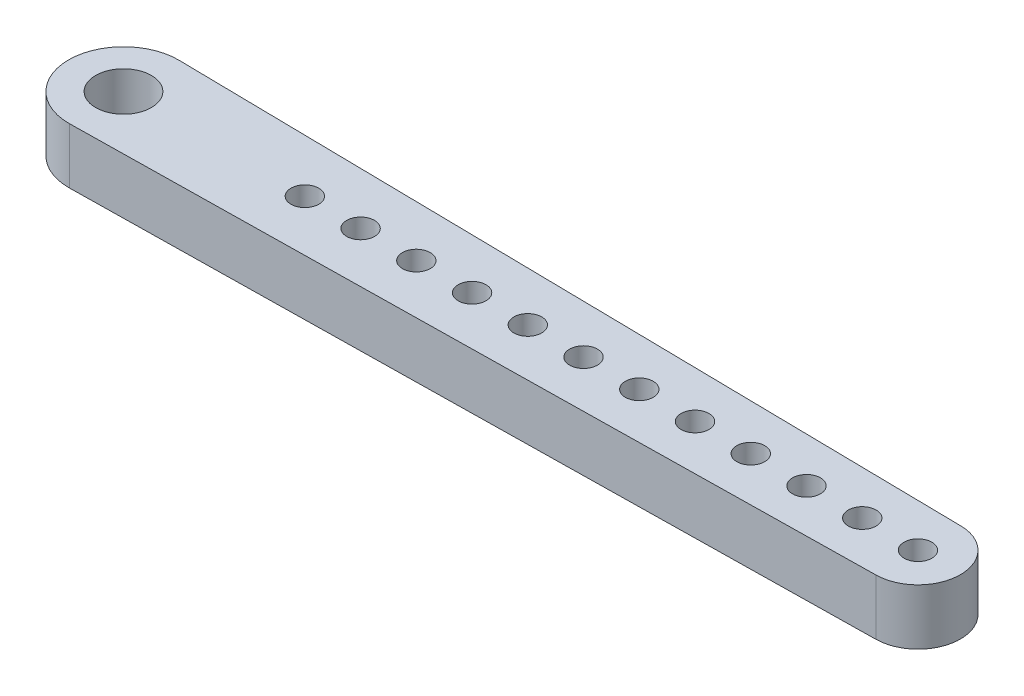
ISO-10303-21;
HEADER;
FILE_DESCRIPTION(('STEP AP214'),'2;1');
FILE_NAME('part.step','',(''),(''),'','','');
FILE_SCHEMA(('AUTOMOTIVE_DESIGN { 1 0 10303 214 1 1 1 1 }'));
ENDSEC;
DATA;
#1=APPLICATION_CONTEXT('core data for automotive mechanical design processes');
#2=APPLICATION_PROTOCOL_DEFINITION('international standard','automotive_design',2000,#1);
#3=PRODUCT_CONTEXT('',#1,'mechanical');
#4=PRODUCT('Part','Part','',(#3));
#5=PRODUCT_RELATED_PRODUCT_CATEGORY('part','',(#4));
#6=PRODUCT_DEFINITION_FORMATION('','',#4);
#7=PRODUCT_DEFINITION_CONTEXT('part definition',#1,'design');
#8=PRODUCT_DEFINITION('design','',#6,#7);
#9=PRODUCT_DEFINITION_SHAPE('','',#8);
#10=(LENGTH_UNIT() NAMED_UNIT(*) SI_UNIT(.MILLI.,.METRE.));
#11=(NAMED_UNIT(*) PLANE_ANGLE_UNIT() SI_UNIT($,.RADIAN.));
#12=(NAMED_UNIT(*) SI_UNIT($,.STERADIAN.) SOLID_ANGLE_UNIT());
#13=UNCERTAINTY_MEASURE_WITH_UNIT(LENGTH_MEASURE(1.E-05),#10,'distance_accuracy_value','');
#14=(GEOMETRIC_REPRESENTATION_CONTEXT(3) GLOBAL_UNCERTAINTY_ASSIGNED_CONTEXT((#13)) GLOBAL_UNIT_ASSIGNED_CONTEXT((#10,
#11,#12)) REPRESENTATION_CONTEXT('',''));
#15=CARTESIAN_POINT('',(0.,0.,0.));
#16=DIRECTION('',(0.,0.,1.));
#17=DIRECTION('',(1.,0.,0.));
#18=AXIS2_PLACEMENT_3D('',#15,#16,#17);
#19=CARTESIAN_POINT('',(6.25155634917897,6.35,0.));
#20=DIRECTION('',(0.,-1.,0.));
#21=DIRECTION('',(0.,0.,-1.));
#22=AXIS2_PLACEMENT_3D('',#19,#20,#21);
#23=CYLINDRICAL_SURFACE('',#22,6.25155634917897);
#24=DIRECTION('',(0.,1.,0.));
#25=VECTOR('',#24,1.);
#26=CARTESIAN_POINT('',(6.34922499542032,6.35,6.25079335944656));
#27=LINE('',#26,#25);
#28=CARTESIAN_POINT('',(6.34922499542032,6.35,6.25079335944656));
#29=VERTEX_POINT('',#28);
#30=CARTESIAN_POINT('',(6.34922499542032,0.,6.25079335944656));
#31=VERTEX_POINT('',#30);
#32=EDGE_CURVE('E97',#29,#31,#27,.F.);
#33=ORIENTED_EDGE('',*,*,#32,.F.);
#34=CARTESIAN_POINT('',(6.25155634917897,6.35,0.));
#35=DIRECTION('',(0.,-1.,0.));
#36=DIRECTION('',(0.,0.,-1.));
#37=AXIS2_PLACEMENT_3D('',#34,#35,#36);
#38=CIRCLE('',#37,6.25155634917897);
#39=CARTESIAN_POINT('',(6.34922499542032,6.35,-6.25079335944656));
#40=VERTEX_POINT('',#39);
#41=EDGE_CURVE('E56',#40,#29,#38,.F.);
#42=ORIENTED_EDGE('',*,*,#41,.F.);
#43=DIRECTION('',(0.,-1.,0.));
#44=VECTOR('',#43,1.);
#45=CARTESIAN_POINT('',(6.34922499542032,6.35,-6.25079335944656));
#46=LINE('',#45,#44);
#47=CARTESIAN_POINT('',(6.34922499542032,0.,-6.25079335944656));
#48=VERTEX_POINT('',#47);
#49=EDGE_CURVE('E113',#48,#40,#46,.F.);
#50=ORIENTED_EDGE('',*,*,#49,.F.);
#51=CARTESIAN_POINT('',(6.25155634917897,0.,0.));
#52=DIRECTION('',(0.,-1.,0.));
#53=DIRECTION('',(0.,0.,-1.));
#54=AXIS2_PLACEMENT_3D('',#51,#52,#53);
#55=CIRCLE('',#54,6.25155634917897);
#56=EDGE_CURVE('E49',#31,#48,#55,.T.);
#57=ORIENTED_EDGE('',*,*,#56,.F.);
#58=EDGE_LOOP('',(#33,#42,#50,#57));
#59=FACE_BOUND('',#58,.T.);
#60=ADVANCED_FACE('F34',(#59),#23,.T.);
#61=CARTESIAN_POINT('',(96.7625046131157,0.,0.));
#62=DIRECTION('',(0.,-1.,0.));
#63=DIRECTION('',(0.,0.,-1.));
#64=AXIS2_PLACEMENT_3D('',#61,#62,#63);
#65=CYLINDRICAL_SURFACE('',#64,4.83749538688425);
#66=DIRECTION('',(0.,1.,0.));
#67=VECTOR('',#66,1.);
#68=CARTESIAN_POINT('',(96.8380812534347,0.,4.83690498041511));
#69=LINE('',#68,#67);
#70=CARTESIAN_POINT('',(96.8380812534347,0.,4.83690498041511));
#71=VERTEX_POINT('',#70);
#72=CARTESIAN_POINT('',(96.8380812534347,6.35,4.83690498041511));
#73=VERTEX_POINT('',#72);
#74=EDGE_CURVE('E88',#71,#73,#69,.T.);
#75=ORIENTED_EDGE('',*,*,#74,.F.);
#76=CARTESIAN_POINT('',(96.7625046131157,0.,0.));
#77=DIRECTION('',(0.,-1.,0.));
#78=DIRECTION('',(0.,0.,-1.));
#79=AXIS2_PLACEMENT_3D('',#76,#77,#78);
#80=CIRCLE('',#79,4.83749538688425);
#81=CARTESIAN_POINT('',(96.8380812534347,0.,-4.83690498041509));
#82=VERTEX_POINT('',#81);
#83=EDGE_CURVE('E73',#82,#71,#80,.T.);
#84=ORIENTED_EDGE('',*,*,#83,.F.);
#85=DIRECTION('',(0.,-1.,0.));
#86=VECTOR('',#85,1.);
#87=CARTESIAN_POINT('',(96.8380812534347,6.35,-4.83690498041509));
#88=LINE('',#87,#86);
#89=CARTESIAN_POINT('',(96.8380812534347,6.35,-4.83690498041509));
#90=VERTEX_POINT('',#89);
#91=EDGE_CURVE('E85',#90,#82,#88,.T.);
#92=ORIENTED_EDGE('',*,*,#91,.F.);
#93=CARTESIAN_POINT('',(96.7625046131157,6.35,0.));
#94=DIRECTION('',(0.,-1.,0.));
#95=DIRECTION('',(0.,0.,-1.));
#96=AXIS2_PLACEMENT_3D('',#93,#94,#95);
#97=CIRCLE('',#96,4.83749538688425);
#98=EDGE_CURVE('E84',#73,#90,#97,.F.);
#99=ORIENTED_EDGE('',*,*,#98,.F.);
#100=EDGE_LOOP('',(#75,#84,#92,#99));
#101=FACE_BOUND('',#100,.T.);
#102=ADVANCED_FACE('F89',(#101),#65,.T.);
#103=CARTESIAN_POINT('',(0.,6.35,-6.35));
#104=DIRECTION('',(-0.015623093000542,0.,0.999877952034695));
#105=DIRECTION('',(0.999877952034695,0.,0.015623093000542));
#106=AXIS2_PLACEMENT_3D('',#103,#104,#105);
#107=PLANE('',#106);
#108=DIRECTION('',(-0.999877952034695,0.,-0.015623093000542));
#109=VECTOR('',#108,1.);
#110=CARTESIAN_POINT('',(0.,0.,-6.35));
#111=LINE('',#110,#109);
#112=EDGE_CURVE('E80',#82,#48,#111,.T.);
#113=ORIENTED_EDGE('',*,*,#112,.T.);
#114=ORIENTED_EDGE('',*,*,#49,.T.);
#115=DIRECTION('',(-0.999877952034695,0.,-0.015623093000542));
#116=VECTOR('',#115,1.);
#117=CARTESIAN_POINT('',(0.,6.35,-6.35));
#118=LINE('',#117,#116);
#119=EDGE_CURVE('E93',#90,#40,#118,.T.);
#120=ORIENTED_EDGE('',*,*,#119,.F.);
#121=ORIENTED_EDGE('',*,*,#91,.T.);
#122=EDGE_LOOP('',(#113,#114,#120,#121));
#123=FACE_BOUND('',#122,.T.);
#124=ADVANCED_FACE('F175',(#123),#107,.F.);
#125=CARTESIAN_POINT('',(0.,6.35,0.));
#126=DIRECTION('',(0.,-1.,0.));
#127=DIRECTION('',(0.,0.,-1.));
#128=AXIS2_PLACEMENT_3D('',#125,#126,#127);
#129=PLANE('',#128);
#130=CARTESIAN_POINT('',(84.0625046131157,6.35,0.));
#131=DIRECTION('',(0.,1.,0.));
#132=DIRECTION('',(0.,0.,1.));
#133=AXIS2_PLACEMENT_3D('',#130,#131,#132);
#134=CIRCLE('',#133,1.5875);
#135=CARTESIAN_POINT('',(84.0625046131157,6.35,1.5875));
#136=VERTEX_POINT('',#135);
#137=EDGE_CURVE('E385',#136,#136,#134,.T.);
#138=ORIENTED_EDGE('',*,*,#137,.F.);
#139=EDGE_LOOP('',(#138));
#140=FACE_BOUND('',#139,.T.);
#141=CARTESIAN_POINT('',(90.4125046131157,6.35,0.));
#142=DIRECTION('',(0.,1.,0.));
#143=DIRECTION('',(0.,0.,1.));
#144=AXIS2_PLACEMENT_3D('',#141,#142,#143);
#145=CIRCLE('',#144,1.5875);
#146=CARTESIAN_POINT('',(90.4125046131157,6.35,1.5875));
#147=VERTEX_POINT('',#146);
#148=EDGE_CURVE('E382',#147,#147,#145,.T.);
#149=ORIENTED_EDGE('',*,*,#148,.F.);
#150=EDGE_LOOP('',(#149));
#151=FACE_BOUND('',#150,.T.);
#152=CARTESIAN_POINT('',(96.7625046131157,6.35,0.));
#153=DIRECTION('',(0.,1.,0.));
#154=DIRECTION('',(0.,0.,1.));
#155=AXIS2_PLACEMENT_3D('',#152,#153,#154);
#156=CIRCLE('',#155,1.5875);
#157=CARTESIAN_POINT('',(96.7625046131157,6.35,1.58750000000001));
#158=VERTEX_POINT('',#157);
#159=EDGE_CURVE('E376',#158,#158,#156,.T.);
#160=ORIENTED_EDGE('',*,*,#159,.F.);
#161=EDGE_LOOP('',(#160));
#162=FACE_BOUND('',#161,.T.);
#163=CARTESIAN_POINT('',(6.25155634917897,6.35,0.));
#164=DIRECTION('',(0.,1.,0.));
#165=DIRECTION('',(0.,0.,1.));
#166=AXIS2_PLACEMENT_3D('',#163,#164,#165);
#167=CIRCLE('',#166,3.175);
#168=CARTESIAN_POINT('',(6.25155634917897,6.35,3.175));
#169=VERTEX_POINT('',#168);
#170=EDGE_CURVE('E103',#169,#169,#167,.T.);
#171=ORIENTED_EDGE('',*,*,#170,.F.);
#172=EDGE_LOOP('',(#171));
#173=FACE_BOUND('',#172,.T.);
#174=ORIENTED_EDGE('',*,*,#119,.T.);
#175=ORIENTED_EDGE('',*,*,#41,.T.);
#176=DIRECTION('',(-0.999877952034695,0.,0.0156230930005419));
#177=VECTOR('',#176,1.);
#178=CARTESIAN_POINT('',(0.,6.35,6.35));
#179=LINE('',#178,#177);
#180=EDGE_CURVE('E98',#73,#29,#179,.T.);
#181=ORIENTED_EDGE('',*,*,#180,.F.);
#182=ORIENTED_EDGE('',*,*,#98,.T.);
#183=EDGE_LOOP('',(#174,#175,#181,#182));
#184=FACE_BOUND('',#183,.T.);
#185=CARTESIAN_POINT('',(77.7125046131158,6.35,0.));
#186=DIRECTION('',(0.,1.,0.));
#187=DIRECTION('',(0.,0.,1.));
#188=AXIS2_PLACEMENT_3D('',#185,#186,#187);
#189=CIRCLE('',#188,1.5875);
#190=CARTESIAN_POINT('',(77.7125046131158,6.35,1.5875));
#191=VERTEX_POINT('',#190);
#192=EDGE_CURVE('E120',#191,#191,#189,.T.);
#193=ORIENTED_EDGE('',*,*,#192,.F.);
#194=EDGE_LOOP('',(#193));
#195=FACE_BOUND('',#194,.T.);
#196=CARTESIAN_POINT('',(71.3625046131157,6.35,0.));
#197=DIRECTION('',(0.,1.,0.));
#198=DIRECTION('',(0.,0.,1.));
#199=AXIS2_PLACEMENT_3D('',#196,#197,#198);
#200=CIRCLE('',#199,1.5875);
#201=CARTESIAN_POINT('',(71.3625046131157,6.35,1.5875));
#202=VERTEX_POINT('',#201);
#203=EDGE_CURVE('E126',#202,#202,#200,.T.);
#204=ORIENTED_EDGE('',*,*,#203,.F.);
#205=EDGE_LOOP('',(#204));
#206=FACE_BOUND('',#205,.T.);
#207=CARTESIAN_POINT('',(65.0125046131158,6.35,0.));
#208=DIRECTION('',(0.,1.,0.));
#209=DIRECTION('',(0.,0.,1.));
#210=AXIS2_PLACEMENT_3D('',#207,#208,#209);
#211=CIRCLE('',#210,1.5875);
#212=CARTESIAN_POINT('',(65.0125046131158,6.35,1.5875));
#213=VERTEX_POINT('',#212);
#214=EDGE_CURVE('E132',#213,#213,#211,.T.);
#215=ORIENTED_EDGE('',*,*,#214,.F.);
#216=EDGE_LOOP('',(#215));
#217=FACE_BOUND('',#216,.T.);
#218=CARTESIAN_POINT('',(58.6625046131158,6.35,0.));
#219=DIRECTION('',(0.,1.,0.));
#220=DIRECTION('',(0.,0.,1.));
#221=AXIS2_PLACEMENT_3D('',#218,#219,#220);
#222=CIRCLE('',#221,1.5875);
#223=CARTESIAN_POINT('',(58.6625046131158,6.35,1.5875));
#224=VERTEX_POINT('',#223);
#225=EDGE_CURVE('E138',#224,#224,#222,.T.);
#226=ORIENTED_EDGE('',*,*,#225,.F.);
#227=EDGE_LOOP('',(#226));
#228=FACE_BOUND('',#227,.T.);
#229=CARTESIAN_POINT('',(52.3125046131158,6.35,0.));
#230=DIRECTION('',(0.,1.,0.));
#231=DIRECTION('',(0.,0.,1.));
#232=AXIS2_PLACEMENT_3D('',#229,#230,#231);
#233=CIRCLE('',#232,1.5875);
#234=CARTESIAN_POINT('',(52.3125046131158,6.35,1.5875));
#235=VERTEX_POINT('',#234);
#236=EDGE_CURVE('E144',#235,#235,#233,.T.);
#237=ORIENTED_EDGE('',*,*,#236,.F.);
#238=EDGE_LOOP('',(#237));
#239=FACE_BOUND('',#238,.T.);
#240=CARTESIAN_POINT('',(45.9625046131158,6.35,0.));
#241=DIRECTION('',(0.,1.,0.));
#242=DIRECTION('',(0.,0.,1.));
#243=AXIS2_PLACEMENT_3D('',#240,#241,#242);
#244=CIRCLE('',#243,1.5875);
#245=CARTESIAN_POINT('',(45.9625046131158,6.35,1.5875));
#246=VERTEX_POINT('',#245);
#247=EDGE_CURVE('E150',#246,#246,#244,.T.);
#248=ORIENTED_EDGE('',*,*,#247,.F.);
#249=EDGE_LOOP('',(#248));
#250=FACE_BOUND('',#249,.T.);
#251=CARTESIAN_POINT('',(39.6125046131158,6.35,0.));
#252=DIRECTION('',(0.,1.,0.));
#253=DIRECTION('',(0.,0.,1.));
#254=AXIS2_PLACEMENT_3D('',#251,#252,#253);
#255=CIRCLE('',#254,1.5875);
#256=CARTESIAN_POINT('',(39.6125046131158,6.35,1.5875));
#257=VERTEX_POINT('',#256);
#258=EDGE_CURVE('E156',#257,#257,#255,.T.);
#259=ORIENTED_EDGE('',*,*,#258,.F.);
#260=EDGE_LOOP('',(#259));
#261=FACE_BOUND('',#260,.T.);
#262=CARTESIAN_POINT('',(33.2625046131158,6.35,0.));
#263=DIRECTION('',(0.,1.,0.));
#264=DIRECTION('',(0.,0.,1.));
#265=AXIS2_PLACEMENT_3D('',#262,#263,#264);
#266=CIRCLE('',#265,1.5875);
#267=CARTESIAN_POINT('',(33.2625046131158,6.35,1.5875));
#268=VERTEX_POINT('',#267);
#269=EDGE_CURVE('E162',#268,#268,#266,.T.);
#270=ORIENTED_EDGE('',*,*,#269,.F.);
#271=EDGE_LOOP('',(#270));
#272=FACE_BOUND('',#271,.T.);
#273=CARTESIAN_POINT('',(26.9125046131158,6.35,0.));
#274=DIRECTION('',(0.,1.,0.));
#275=DIRECTION('',(0.,0.,1.));
#276=AXIS2_PLACEMENT_3D('',#273,#274,#275);
#277=CIRCLE('',#276,1.5875);
#278=CARTESIAN_POINT('',(26.9125046131158,6.35,1.58749999999999));
#279=VERTEX_POINT('',#278);
#280=EDGE_CURVE('E11',#279,#279,#277,.T.);
#281=ORIENTED_EDGE('',*,*,#280,.F.);
#282=EDGE_LOOP('',(#281));
#283=FACE_BOUND('',#282,.T.);
#284=ADVANCED_FACE('F173',(#140,#151,#162,#173,#184,#195,#206,#217,#228,#239,#250,#261,#272,
#283),#129,.F.);
#285=CARTESIAN_POINT('',(0.,0.,0.));
#286=DIRECTION('',(0.,-1.,0.));
#287=DIRECTION('',(0.,0.,-1.));
#288=AXIS2_PLACEMENT_3D('',#285,#286,#287);
#289=PLANE('',#288);
#290=CARTESIAN_POINT('',(84.0625046131157,0.,0.));
#291=DIRECTION('',(0.,1.,0.));
#292=DIRECTION('',(0.,0.,1.));
#293=AXIS2_PLACEMENT_3D('',#290,#291,#292);
#294=CIRCLE('',#293,1.5875);
#295=CARTESIAN_POINT('',(84.0625046131157,0.,1.5875));
#296=VERTEX_POINT('',#295);
#297=EDGE_CURVE('E390',#296,#296,#294,.T.);
#298=ORIENTED_EDGE('',*,*,#297,.T.);
#299=EDGE_LOOP('',(#298));
#300=FACE_BOUND('',#299,.T.);
#301=CARTESIAN_POINT('',(90.4125046131157,0.,0.));
#302=DIRECTION('',(0.,1.,0.));
#303=DIRECTION('',(0.,0.,1.));
#304=AXIS2_PLACEMENT_3D('',#301,#302,#303);
#305=CIRCLE('',#304,1.5875);
#306=CARTESIAN_POINT('',(90.4125046131157,0.,1.5875));
#307=VERTEX_POINT('',#306);
#308=EDGE_CURVE('E380',#307,#307,#305,.T.);
#309=ORIENTED_EDGE('',*,*,#308,.T.);
#310=EDGE_LOOP('',(#309));
#311=FACE_BOUND('',#310,.T.);
#312=CARTESIAN_POINT('',(96.7625046131157,0.,0.));
#313=DIRECTION('',(0.,1.,0.));
#314=DIRECTION('',(0.,0.,1.));
#315=AXIS2_PLACEMENT_3D('',#312,#313,#314);
#316=CIRCLE('',#315,1.5875);
#317=CARTESIAN_POINT('',(96.7625046131157,0.,1.58750000000001));
#318=VERTEX_POINT('',#317);
#319=EDGE_CURVE('E374',#318,#318,#316,.T.);
#320=ORIENTED_EDGE('',*,*,#319,.T.);
#321=EDGE_LOOP('',(#320));
#322=FACE_BOUND('',#321,.T.);
#323=CARTESIAN_POINT('',(6.25155634917897,0.,0.));
#324=DIRECTION('',(0.,1.,0.));
#325=DIRECTION('',(0.,0.,1.));
#326=AXIS2_PLACEMENT_3D('',#323,#324,#325);
#327=CIRCLE('',#326,3.175);
#328=CARTESIAN_POINT('',(6.25155634917897,0.,3.175));
#329=VERTEX_POINT('',#328);
#330=EDGE_CURVE('E99',#329,#329,#327,.T.);
#331=ORIENTED_EDGE('',*,*,#330,.T.);
#332=EDGE_LOOP('',(#331));
#333=FACE_BOUND('',#332,.T.);
#334=DIRECTION('',(-0.999877952034695,0.,0.0156230930005419));
#335=VECTOR('',#334,1.);
#336=CARTESIAN_POINT('',(0.,0.,6.35));
#337=LINE('',#336,#335);
#338=EDGE_CURVE('E78',#71,#31,#337,.T.);
#339=ORIENTED_EDGE('',*,*,#338,.T.);
#340=ORIENTED_EDGE('',*,*,#56,.T.);
#341=ORIENTED_EDGE('',*,*,#112,.F.);
#342=ORIENTED_EDGE('',*,*,#83,.T.);
#343=EDGE_LOOP('',(#339,#340,#341,#342));
#344=FACE_BOUND('',#343,.T.);
#345=CARTESIAN_POINT('',(77.7125046131158,0.,0.));
#346=DIRECTION('',(0.,1.,0.));
#347=DIRECTION('',(0.,0.,1.));
#348=AXIS2_PLACEMENT_3D('',#345,#346,#347);
#349=CIRCLE('',#348,1.5875);
#350=CARTESIAN_POINT('',(77.7125046131158,0.,1.5875));
#351=VERTEX_POINT('',#350);
#352=EDGE_CURVE('E117',#351,#351,#349,.T.);
#353=ORIENTED_EDGE('',*,*,#352,.T.);
#354=EDGE_LOOP('',(#353));
#355=FACE_BOUND('',#354,.T.);
#356=CARTESIAN_POINT('',(71.3625046131157,0.,0.));
#357=DIRECTION('',(0.,1.,0.));
#358=DIRECTION('',(0.,0.,1.));
#359=AXIS2_PLACEMENT_3D('',#356,#357,#358);
#360=CIRCLE('',#359,1.5875);
#361=CARTESIAN_POINT('',(71.3625046131157,0.,1.5875));
#362=VERTEX_POINT('',#361);
#363=EDGE_CURVE('E123',#362,#362,#360,.T.);
#364=ORIENTED_EDGE('',*,*,#363,.T.);
#365=EDGE_LOOP('',(#364));
#366=FACE_BOUND('',#365,.T.);
#367=CARTESIAN_POINT('',(65.0125046131158,0.,0.));
#368=DIRECTION('',(0.,1.,0.));
#369=DIRECTION('',(0.,0.,1.));
#370=AXIS2_PLACEMENT_3D('',#367,#368,#369);
#371=CIRCLE('',#370,1.5875);
#372=CARTESIAN_POINT('',(65.0125046131158,0.,1.5875));
#373=VERTEX_POINT('',#372);
#374=EDGE_CURVE('E129',#373,#373,#371,.T.);
#375=ORIENTED_EDGE('',*,*,#374,.T.);
#376=EDGE_LOOP('',(#375));
#377=FACE_BOUND('',#376,.T.);
#378=CARTESIAN_POINT('',(58.6625046131158,0.,0.));
#379=DIRECTION('',(0.,1.,0.));
#380=DIRECTION('',(0.,0.,1.));
#381=AXIS2_PLACEMENT_3D('',#378,#379,#380);
#382=CIRCLE('',#381,1.5875);
#383=CARTESIAN_POINT('',(58.6625046131158,0.,1.5875));
#384=VERTEX_POINT('',#383);
#385=EDGE_CURVE('E135',#384,#384,#382,.T.);
#386=ORIENTED_EDGE('',*,*,#385,.T.);
#387=EDGE_LOOP('',(#386));
#388=FACE_BOUND('',#387,.T.);
#389=CARTESIAN_POINT('',(52.3125046131158,0.,0.));
#390=DIRECTION('',(0.,1.,0.));
#391=DIRECTION('',(0.,0.,1.));
#392=AXIS2_PLACEMENT_3D('',#389,#390,#391);
#393=CIRCLE('',#392,1.5875);
#394=CARTESIAN_POINT('',(52.3125046131158,0.,1.5875));
#395=VERTEX_POINT('',#394);
#396=EDGE_CURVE('E141',#395,#395,#393,.T.);
#397=ORIENTED_EDGE('',*,*,#396,.T.);
#398=EDGE_LOOP('',(#397));
#399=FACE_BOUND('',#398,.T.);
#400=CARTESIAN_POINT('',(45.9625046131158,0.,0.));
#401=DIRECTION('',(0.,1.,0.));
#402=DIRECTION('',(0.,0.,1.));
#403=AXIS2_PLACEMENT_3D('',#400,#401,#402);
#404=CIRCLE('',#403,1.5875);
#405=CARTESIAN_POINT('',(45.9625046131158,0.,1.5875));
#406=VERTEX_POINT('',#405);
#407=EDGE_CURVE('E147',#406,#406,#404,.T.);
#408=ORIENTED_EDGE('',*,*,#407,.T.);
#409=EDGE_LOOP('',(#408));
#410=FACE_BOUND('',#409,.T.);
#411=CARTESIAN_POINT('',(39.6125046131158,0.,0.));
#412=DIRECTION('',(0.,1.,0.));
#413=DIRECTION('',(0.,0.,1.));
#414=AXIS2_PLACEMENT_3D('',#411,#412,#413);
#415=CIRCLE('',#414,1.5875);
#416=CARTESIAN_POINT('',(39.6125046131158,0.,1.5875));
#417=VERTEX_POINT('',#416);
#418=EDGE_CURVE('E153',#417,#417,#415,.T.);
#419=ORIENTED_EDGE('',*,*,#418,.T.);
#420=EDGE_LOOP('',(#419));
#421=FACE_BOUND('',#420,.T.);
#422=CARTESIAN_POINT('',(33.2625046131158,0.,0.));
#423=DIRECTION('',(0.,1.,0.));
#424=DIRECTION('',(0.,0.,1.));
#425=AXIS2_PLACEMENT_3D('',#422,#423,#424);
#426=CIRCLE('',#425,1.5875);
#427=CARTESIAN_POINT('',(33.2625046131158,0.,1.5875));
#428=VERTEX_POINT('',#427);
#429=EDGE_CURVE('E159',#428,#428,#426,.T.);
#430=ORIENTED_EDGE('',*,*,#429,.T.);
#431=EDGE_LOOP('',(#430));
#432=FACE_BOUND('',#431,.T.);
#433=CARTESIAN_POINT('',(26.9125046131158,0.,0.));
#434=DIRECTION('',(0.,1.,0.));
#435=DIRECTION('',(0.,0.,1.));
#436=AXIS2_PLACEMENT_3D('',#433,#434,#435);
#437=CIRCLE('',#436,1.5875);
#438=CARTESIAN_POINT('',(26.9125046131158,0.,1.58749999999999));
#439=VERTEX_POINT('',#438);
#440=EDGE_CURVE('E42',#439,#439,#437,.T.);
#441=ORIENTED_EDGE('',*,*,#440,.T.);
#442=EDGE_LOOP('',(#441));
#443=FACE_BOUND('',#442,.T.);
#444=ADVANCED_FACE('F75',(#300,#311,#322,#333,#344,#355,#366,#377,#388,#399,#410,#421,#432,
#443),#289,.T.);
#445=CARTESIAN_POINT('',(0.,6.35,6.35));
#446=DIRECTION('',(0.0156230930005419,0.,0.999877952034695));
#447=DIRECTION('',(0.999877952034695,0.,-0.0156230930005419));
#448=AXIS2_PLACEMENT_3D('',#445,#446,#447);
#449=PLANE('',#448);
#450=ORIENTED_EDGE('',*,*,#180,.T.);
#451=ORIENTED_EDGE('',*,*,#32,.T.);
#452=ORIENTED_EDGE('',*,*,#338,.F.);
#453=ORIENTED_EDGE('',*,*,#74,.T.);
#454=EDGE_LOOP('',(#450,#451,#452,#453));
#455=FACE_BOUND('',#454,.T.);
#456=ADVANCED_FACE('F96',(#455),#449,.T.);
#457=CARTESIAN_POINT('',(6.25155634917897,0.,0.));
#458=DIRECTION('',(0.,1.,0.));
#459=DIRECTION('',(0.,0.,1.));
#460=AXIS2_PLACEMENT_3D('',#457,#458,#459);
#461=CYLINDRICAL_SURFACE('',#460,3.175);
#462=ORIENTED_EDGE('',*,*,#330,.F.);
#463=EDGE_LOOP('',(#462));
#464=FACE_BOUND('',#463,.T.);
#465=ORIENTED_EDGE('',*,*,#170,.T.);
#466=EDGE_LOOP('',(#465));
#467=FACE_BOUND('',#466,.T.);
#468=ADVANCED_FACE('F304',(#464,#467),#461,.F.);
#469=CARTESIAN_POINT('',(96.7625046131157,0.,0.));
#470=DIRECTION('',(0.,1.,0.));
#471=DIRECTION('',(0.,0.,1.));
#472=AXIS2_PLACEMENT_3D('',#469,#470,#471);
#473=CYLINDRICAL_SURFACE('',#472,1.5875);
#474=ORIENTED_EDGE('',*,*,#319,.F.);
#475=EDGE_LOOP('',(#474));
#476=FACE_BOUND('',#475,.T.);
#477=ORIENTED_EDGE('',*,*,#159,.T.);
#478=EDGE_LOOP('',(#477));
#479=FACE_BOUND('',#478,.T.);
#480=ADVANCED_FACE('F295',(#476,#479),#473,.F.);
#481=CARTESIAN_POINT('',(90.4125046131157,0.,0.));
#482=DIRECTION('',(0.,1.,0.));
#483=DIRECTION('',(0.,0.,1.));
#484=AXIS2_PLACEMENT_3D('',#481,#482,#483);
#485=CYLINDRICAL_SURFACE('',#484,1.5875);
#486=ORIENTED_EDGE('',*,*,#308,.F.);
#487=EDGE_LOOP('',(#486));
#488=FACE_BOUND('',#487,.T.);
#489=ORIENTED_EDGE('',*,*,#148,.T.);
#490=EDGE_LOOP('',(#489));
#491=FACE_BOUND('',#490,.T.);
#492=ADVANCED_FACE('F285',(#488,#491),#485,.F.);
#493=CARTESIAN_POINT('',(84.0625046131157,0.,0.));
#494=DIRECTION('',(0.,1.,0.));
#495=DIRECTION('',(0.,0.,1.));
#496=AXIS2_PLACEMENT_3D('',#493,#494,#495);
#497=CYLINDRICAL_SURFACE('',#496,1.5875);
#498=ORIENTED_EDGE('',*,*,#297,.F.);
#499=EDGE_LOOP('',(#498));
#500=FACE_BOUND('',#499,.T.);
#501=ORIENTED_EDGE('',*,*,#137,.T.);
#502=EDGE_LOOP('',(#501));
#503=FACE_BOUND('',#502,.T.);
#504=ADVANCED_FACE('F200',(#500,#503),#497,.F.);
#505=CARTESIAN_POINT('',(77.7125046131158,0.,0.));
#506=DIRECTION('',(0.,1.,0.));
#507=DIRECTION('',(0.,0.,1.));
#508=AXIS2_PLACEMENT_3D('',#505,#506,#507);
#509=CYLINDRICAL_SURFACE('',#508,1.5875);
#510=ORIENTED_EDGE('',*,*,#352,.F.);
#511=EDGE_LOOP('',(#510));
#512=FACE_BOUND('',#511,.T.);
#513=ORIENTED_EDGE('',*,*,#192,.T.);
#514=EDGE_LOOP('',(#513));
#515=FACE_BOUND('',#514,.T.);
#516=ADVANCED_FACE('F196',(#512,#515),#509,.F.);
#517=CARTESIAN_POINT('',(71.3625046131157,0.,0.));
#518=DIRECTION('',(0.,1.,0.));
#519=DIRECTION('',(0.,0.,1.));
#520=AXIS2_PLACEMENT_3D('',#517,#518,#519);
#521=CYLINDRICAL_SURFACE('',#520,1.5875);
#522=ORIENTED_EDGE('',*,*,#363,.F.);
#523=EDGE_LOOP('',(#522));
#524=FACE_BOUND('',#523,.T.);
#525=ORIENTED_EDGE('',*,*,#203,.T.);
#526=EDGE_LOOP('',(#525));
#527=FACE_BOUND('',#526,.T.);
#528=ADVANCED_FACE('F199',(#524,#527),#521,.F.);
#529=CARTESIAN_POINT('',(65.0125046131158,0.,0.));
#530=DIRECTION('',(0.,1.,0.));
#531=DIRECTION('',(0.,0.,1.));
#532=AXIS2_PLACEMENT_3D('',#529,#530,#531);
#533=CYLINDRICAL_SURFACE('',#532,1.5875);
#534=ORIENTED_EDGE('',*,*,#374,.F.);
#535=EDGE_LOOP('',(#534));
#536=FACE_BOUND('',#535,.T.);
#537=ORIENTED_EDGE('',*,*,#214,.T.);
#538=EDGE_LOOP('',(#537));
#539=FACE_BOUND('',#538,.T.);
#540=ADVANCED_FACE('F204',(#536,#539),#533,.F.);
#541=CARTESIAN_POINT('',(58.6625046131158,0.,0.));
#542=DIRECTION('',(0.,1.,0.));
#543=DIRECTION('',(0.,0.,1.));
#544=AXIS2_PLACEMENT_3D('',#541,#542,#543);
#545=CYLINDRICAL_SURFACE('',#544,1.5875);
#546=ORIENTED_EDGE('',*,*,#385,.F.);
#547=EDGE_LOOP('',(#546));
#548=FACE_BOUND('',#547,.T.);
#549=ORIENTED_EDGE('',*,*,#225,.T.);
#550=EDGE_LOOP('',(#549));
#551=FACE_BOUND('',#550,.T.);
#552=ADVANCED_FACE('F208',(#548,#551),#545,.F.);
#553=CARTESIAN_POINT('',(52.3125046131158,0.,0.));
#554=DIRECTION('',(0.,1.,0.));
#555=DIRECTION('',(0.,0.,1.));
#556=AXIS2_PLACEMENT_3D('',#553,#554,#555);
#557=CYLINDRICAL_SURFACE('',#556,1.5875);
#558=ORIENTED_EDGE('',*,*,#396,.F.);
#559=EDGE_LOOP('',(#558));
#560=FACE_BOUND('',#559,.T.);
#561=ORIENTED_EDGE('',*,*,#236,.T.);
#562=EDGE_LOOP('',(#561));
#563=FACE_BOUND('',#562,.T.);
#564=ADVANCED_FACE('F212',(#560,#563),#557,.F.);
#565=CARTESIAN_POINT('',(45.9625046131158,0.,0.));
#566=DIRECTION('',(0.,1.,0.));
#567=DIRECTION('',(0.,0.,1.));
#568=AXIS2_PLACEMENT_3D('',#565,#566,#567);
#569=CYLINDRICAL_SURFACE('',#568,1.5875);
#570=ORIENTED_EDGE('',*,*,#407,.F.);
#571=EDGE_LOOP('',(#570));
#572=FACE_BOUND('',#571,.T.);
#573=ORIENTED_EDGE('',*,*,#247,.T.);
#574=EDGE_LOOP('',(#573));
#575=FACE_BOUND('',#574,.T.);
#576=ADVANCED_FACE('F216',(#572,#575),#569,.F.);
#577=CARTESIAN_POINT('',(39.6125046131158,0.,0.));
#578=DIRECTION('',(0.,1.,0.));
#579=DIRECTION('',(0.,0.,1.));
#580=AXIS2_PLACEMENT_3D('',#577,#578,#579);
#581=CYLINDRICAL_SURFACE('',#580,1.5875);
#582=ORIENTED_EDGE('',*,*,#418,.F.);
#583=EDGE_LOOP('',(#582));
#584=FACE_BOUND('',#583,.T.);
#585=ORIENTED_EDGE('',*,*,#258,.T.);
#586=EDGE_LOOP('',(#585));
#587=FACE_BOUND('',#586,.T.);
#588=ADVANCED_FACE('F220',(#584,#587),#581,.F.);
#589=CARTESIAN_POINT('',(33.2625046131158,0.,0.));
#590=DIRECTION('',(0.,1.,0.));
#591=DIRECTION('',(0.,0.,1.));
#592=AXIS2_PLACEMENT_3D('',#589,#590,#591);
#593=CYLINDRICAL_SURFACE('',#592,1.5875);
#594=ORIENTED_EDGE('',*,*,#429,.F.);
#595=EDGE_LOOP('',(#594));
#596=FACE_BOUND('',#595,.T.);
#597=ORIENTED_EDGE('',*,*,#269,.T.);
#598=EDGE_LOOP('',(#597));
#599=FACE_BOUND('',#598,.T.);
#600=ADVANCED_FACE('F170',(#596,#599),#593,.F.);
#601=CARTESIAN_POINT('',(26.9125046131158,0.,0.));
#602=DIRECTION('',(0.,1.,0.));
#603=DIRECTION('',(0.,0.,1.));
#604=AXIS2_PLACEMENT_3D('',#601,#602,#603);
#605=CYLINDRICAL_SURFACE('',#604,1.5875);
#606=ORIENTED_EDGE('',*,*,#440,.F.);
#607=EDGE_LOOP('',(#606));
#608=FACE_BOUND('',#607,.T.);
#609=ORIENTED_EDGE('',*,*,#280,.T.);
#610=EDGE_LOOP('',(#609));
#611=FACE_BOUND('',#610,.T.);
#612=ADVANCED_FACE('F36',(#608,#611),#605,.F.);
#613=CLOSED_SHELL('',(#60,#102,#124,#284,#444,#456,#468,#480,#492,#504,#516,#528,#540,#552,#564,
#576,#588,#600,#612));
#614=MANIFOLD_SOLID_BREP('B2',#613);
#615=ADVANCED_BREP_SHAPE_REPRESENTATION('',(#18,#614),#14);
#616=SHAPE_DEFINITION_REPRESENTATION(#9,#615);
ENDSEC;
END-ISO-10303-21;
